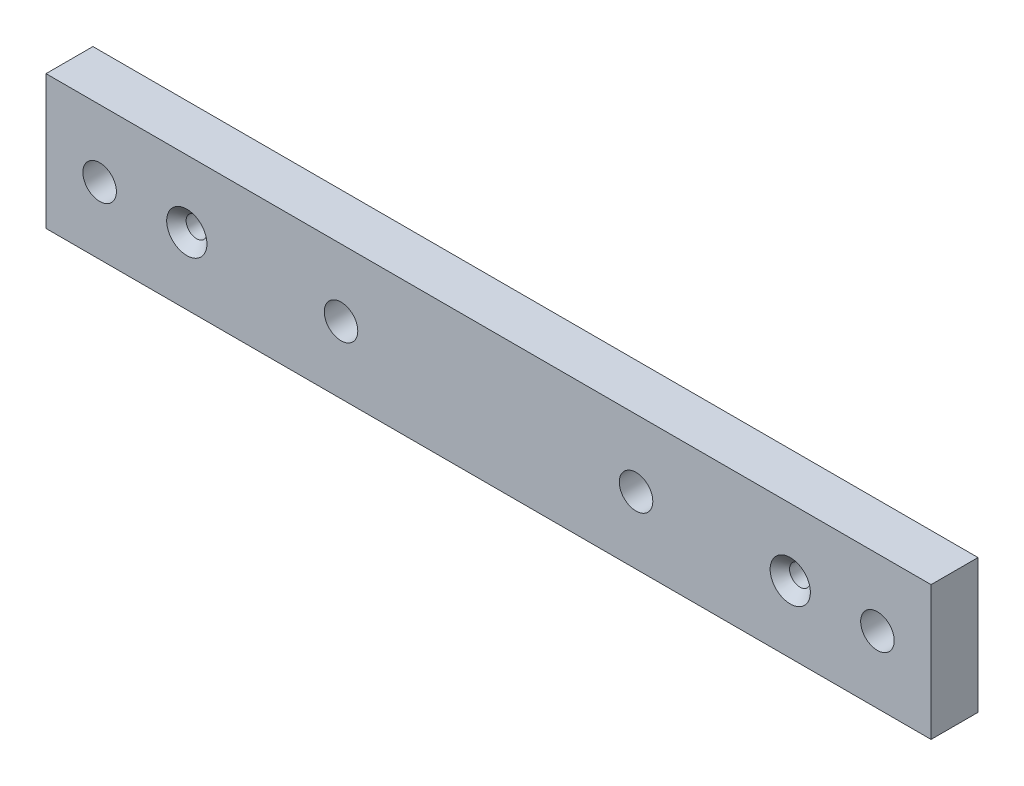
ISO-10303-21;
HEADER;
FILE_DESCRIPTION(('STEP AP214'),'2;1');
FILE_NAME('part.step','',(''),(''),'','','');
FILE_SCHEMA(('AUTOMOTIVE_DESIGN { 1 0 10303 214 1 1 1 1 }'));
ENDSEC;
DATA;
#1=APPLICATION_CONTEXT('core data for automotive mechanical design processes');
#2=APPLICATION_PROTOCOL_DEFINITION('international standard','automotive_design',2000,#1);
#3=PRODUCT_CONTEXT('',#1,'mechanical');
#4=PRODUCT('Part','Part','',(#3));
#5=PRODUCT_RELATED_PRODUCT_CATEGORY('part','',(#4));
#6=PRODUCT_DEFINITION_FORMATION('','',#4);
#7=PRODUCT_DEFINITION_CONTEXT('part definition',#1,'design');
#8=PRODUCT_DEFINITION('design','',#6,#7);
#9=PRODUCT_DEFINITION_SHAPE('','',#8);
#10=(LENGTH_UNIT() NAMED_UNIT(*) SI_UNIT(.MILLI.,.METRE.));
#11=(NAMED_UNIT(*) PLANE_ANGLE_UNIT() SI_UNIT($,.RADIAN.));
#12=(NAMED_UNIT(*) SI_UNIT($,.STERADIAN.) SOLID_ANGLE_UNIT());
#13=UNCERTAINTY_MEASURE_WITH_UNIT(LENGTH_MEASURE(1.E-05),#10,'distance_accuracy_value','');
#14=(GEOMETRIC_REPRESENTATION_CONTEXT(3) GLOBAL_UNCERTAINTY_ASSIGNED_CONTEXT((#13)) GLOBAL_UNIT_ASSIGNED_CONTEXT((#10,
#11,#12)) REPRESENTATION_CONTEXT('',''));
#15=CARTESIAN_POINT('',(0.,0.,0.));
#16=DIRECTION('',(0.,0.,1.));
#17=DIRECTION('',(1.,0.,0.));
#18=AXIS2_PLACEMENT_3D('',#15,#16,#17);
#19=CARTESIAN_POINT('',(0.,0.,7.));
#20=DIRECTION('',(0.,0.,-1.));
#21=DIRECTION('',(-1.,0.,0.));
#22=AXIS2_PLACEMENT_3D('',#19,#20,#21);
#23=PLANE('',#22);
#24=CARTESIAN_POINT('',(-58.,0.,7.));
#25=DIRECTION('',(0.,0.,1.));
#26=DIRECTION('',(1.,0.,0.));
#27=AXIS2_PLACEMENT_3D('',#24,#25,#26);
#28=CIRCLE('',#27,2.5);
#29=CARTESIAN_POINT('',(-55.5,0.,7.));
#30=VERTEX_POINT('',#29);
#31=EDGE_CURVE('E126',#30,#30,#28,.T.);
#32=ORIENTED_EDGE('',*,*,#31,.F.);
#33=EDGE_LOOP('',(#32));
#34=FACE_BOUND('',#33,.T.);
#35=CARTESIAN_POINT('',(58.,0.,7.));
#36=DIRECTION('',(0.,0.,1.));
#37=DIRECTION('',(1.,0.,0.));
#38=AXIS2_PLACEMENT_3D('',#35,#36,#37);
#39=CIRCLE('',#38,2.49999999999999);
#40=CARTESIAN_POINT('',(60.5,0.,7.));
#41=VERTEX_POINT('',#40);
#42=EDGE_CURVE('E120',#41,#41,#39,.T.);
#43=ORIENTED_EDGE('',*,*,#42,.F.);
#44=EDGE_LOOP('',(#43));
#45=FACE_BOUND('',#44,.T.);
#46=CARTESIAN_POINT('',(22.,0.,7.));
#47=DIRECTION('',(0.,0.,1.));
#48=DIRECTION('',(1.,0.,0.));
#49=AXIS2_PLACEMENT_3D('',#46,#47,#48);
#50=CIRCLE('',#49,2.5);
#51=CARTESIAN_POINT('',(24.5,0.,7.));
#52=VERTEX_POINT('',#51);
#53=EDGE_CURVE('E114',#52,#52,#50,.T.);
#54=ORIENTED_EDGE('',*,*,#53,.F.);
#55=EDGE_LOOP('',(#54));
#56=FACE_BOUND('',#55,.T.);
#57=CARTESIAN_POINT('',(-22.,0.,7.));
#58=DIRECTION('',(0.,0.,1.));
#59=DIRECTION('',(1.,0.,0.));
#60=AXIS2_PLACEMENT_3D('',#57,#58,#59);
#61=CIRCLE('',#60,2.5);
#62=CARTESIAN_POINT('',(-19.5,0.,7.));
#63=VERTEX_POINT('',#62);
#64=EDGE_CURVE('E99',#63,#63,#61,.T.);
#65=ORIENTED_EDGE('',*,*,#64,.F.);
#66=EDGE_LOOP('',(#65));
#67=FACE_BOUND('',#66,.T.);
#68=DIRECTION('',(0.,1.,0.));
#69=VECTOR('',#68,1.);
#70=CARTESIAN_POINT('',(66.,-10.,7.));
#71=LINE('',#70,#69);
#72=CARTESIAN_POINT('',(66.,-10.,7.));
#73=VERTEX_POINT('',#72);
#74=CARTESIAN_POINT('',(66.,10.,7.));
#75=VERTEX_POINT('',#74);
#76=EDGE_CURVE('E84',#73,#75,#71,.T.);
#77=ORIENTED_EDGE('',*,*,#76,.T.);
#78=DIRECTION('',(-1.,0.,0.));
#79=VECTOR('',#78,1.);
#80=CARTESIAN_POINT('',(-66.,10.,7.));
#81=LINE('',#80,#79);
#82=CARTESIAN_POINT('',(-66.,10.,7.));
#83=VERTEX_POINT('',#82);
#84=EDGE_CURVE('E79',#75,#83,#81,.T.);
#85=ORIENTED_EDGE('',*,*,#84,.T.);
#86=DIRECTION('',(0.,-1.,0.));
#87=VECTOR('',#86,1.);
#88=CARTESIAN_POINT('',(-66.,-10.,7.));
#89=LINE('',#88,#87);
#90=CARTESIAN_POINT('',(-66.,-10.,7.));
#91=VERTEX_POINT('',#90);
#92=EDGE_CURVE('E82',#83,#91,#89,.T.);
#93=ORIENTED_EDGE('',*,*,#92,.T.);
#94=DIRECTION('',(1.,0.,0.));
#95=VECTOR('',#94,1.);
#96=CARTESIAN_POINT('',(-66.,-10.,7.));
#97=LINE('',#96,#95);
#98=EDGE_CURVE('E49',#91,#73,#97,.T.);
#99=ORIENTED_EDGE('',*,*,#98,.T.);
#100=EDGE_LOOP('',(#77,#85,#93,#99));
#101=FACE_BOUND('',#100,.T.);
#102=CARTESIAN_POINT('',(45.,0.,7.));
#103=DIRECTION('',(0.,0.,1.));
#104=DIRECTION('',(1.,0.,0.));
#105=AXIS2_PLACEMENT_3D('',#102,#103,#104);
#106=CIRCLE('',#105,3.);
#107=CARTESIAN_POINT('',(48.,0.,7.));
#108=VERTEX_POINT('',#107);
#109=EDGE_CURVE('E140',#108,#108,#106,.T.);
#110=ORIENTED_EDGE('',*,*,#109,.F.);
#111=EDGE_LOOP('',(#110));
#112=FACE_BOUND('',#111,.T.);
#113=CARTESIAN_POINT('',(-45.,0.,7.));
#114=DIRECTION('',(0.,0.,1.));
#115=DIRECTION('',(1.,0.,0.));
#116=AXIS2_PLACEMENT_3D('',#113,#114,#115);
#117=CIRCLE('',#116,3.);
#118=CARTESIAN_POINT('',(-42.,0.,7.));
#119=VERTEX_POINT('',#118);
#120=EDGE_CURVE('E149',#119,#119,#117,.T.);
#121=ORIENTED_EDGE('',*,*,#120,.F.);
#122=EDGE_LOOP('',(#121));
#123=FACE_BOUND('',#122,.T.);
#124=ADVANCED_FACE('F32',(#34,#45,#56,#67,#101,#112,#123),#23,.F.);
#125=CARTESIAN_POINT('',(0.,0.,0.));
#126=DIRECTION('',(0.,0.,-1.));
#127=DIRECTION('',(-1.,0.,0.));
#128=AXIS2_PLACEMENT_3D('',#125,#126,#127);
#129=PLANE('',#128);
#130=CARTESIAN_POINT('',(-45.,0.,0.));
#131=DIRECTION('',(0.,0.,1.));
#132=DIRECTION('',(1.,0.,0.));
#133=AXIS2_PLACEMENT_3D('',#130,#131,#132);
#134=CIRCLE('',#133,1.55);
#135=CARTESIAN_POINT('',(-43.45,0.,0.));
#136=VERTEX_POINT('',#135);
#137=EDGE_CURVE('E143',#136,#136,#134,.T.);
#138=ORIENTED_EDGE('',*,*,#137,.T.);
#139=EDGE_LOOP('',(#138));
#140=FACE_BOUND('',#139,.T.);
#141=CARTESIAN_POINT('',(-58.,0.,0.));
#142=DIRECTION('',(0.,0.,1.));
#143=DIRECTION('',(1.,0.,0.));
#144=AXIS2_PLACEMENT_3D('',#141,#142,#143);
#145=CIRCLE('',#144,2.5);
#146=CARTESIAN_POINT('',(-55.5,0.,0.));
#147=VERTEX_POINT('',#146);
#148=EDGE_CURVE('E129',#147,#147,#145,.T.);
#149=ORIENTED_EDGE('',*,*,#148,.T.);
#150=EDGE_LOOP('',(#149));
#151=FACE_BOUND('',#150,.T.);
#152=CARTESIAN_POINT('',(22.,0.,0.));
#153=DIRECTION('',(0.,0.,1.));
#154=DIRECTION('',(1.,0.,0.));
#155=AXIS2_PLACEMENT_3D('',#152,#153,#154);
#156=CIRCLE('',#155,2.5);
#157=CARTESIAN_POINT('',(24.5,0.,0.));
#158=VERTEX_POINT('',#157);
#159=EDGE_CURVE('E117',#158,#158,#156,.T.);
#160=ORIENTED_EDGE('',*,*,#159,.T.);
#161=EDGE_LOOP('',(#160));
#162=FACE_BOUND('',#161,.T.);
#163=DIRECTION('',(0.,1.,0.));
#164=VECTOR('',#163,1.);
#165=CARTESIAN_POINT('',(66.,-10.,0.));
#166=LINE('',#165,#164);
#167=CARTESIAN_POINT('',(66.,-10.,0.));
#168=VERTEX_POINT('',#167);
#169=CARTESIAN_POINT('',(66.,10.,0.));
#170=VERTEX_POINT('',#169);
#171=EDGE_CURVE('E96',#168,#170,#166,.T.);
#172=ORIENTED_EDGE('',*,*,#171,.F.);
#173=DIRECTION('',(1.,0.,0.));
#174=VECTOR('',#173,1.);
#175=CARTESIAN_POINT('',(-66.,-10.,0.));
#176=LINE('',#175,#174);
#177=CARTESIAN_POINT('',(-66.,-10.,0.));
#178=VERTEX_POINT('',#177);
#179=EDGE_CURVE('E72',#178,#168,#176,.T.);
#180=ORIENTED_EDGE('',*,*,#179,.F.);
#181=DIRECTION('',(0.,-1.,0.));
#182=VECTOR('',#181,1.);
#183=CARTESIAN_POINT('',(-66.,-10.,0.));
#184=LINE('',#183,#182);
#185=CARTESIAN_POINT('',(-66.,10.,0.));
#186=VERTEX_POINT('',#185);
#187=EDGE_CURVE('E66',#186,#178,#184,.T.);
#188=ORIENTED_EDGE('',*,*,#187,.F.);
#189=DIRECTION('',(-1.,0.,0.));
#190=VECTOR('',#189,1.);
#191=CARTESIAN_POINT('',(-66.,10.,0.));
#192=LINE('',#191,#190);
#193=EDGE_CURVE('E88',#170,#186,#192,.T.);
#194=ORIENTED_EDGE('',*,*,#193,.F.);
#195=EDGE_LOOP('',(#172,#180,#188,#194));
#196=FACE_BOUND('',#195,.T.);
#197=CARTESIAN_POINT('',(-22.,0.,0.));
#198=DIRECTION('',(0.,0.,1.));
#199=DIRECTION('',(1.,0.,0.));
#200=AXIS2_PLACEMENT_3D('',#197,#198,#199);
#201=CIRCLE('',#200,2.5);
#202=CARTESIAN_POINT('',(-19.5,0.,0.));
#203=VERTEX_POINT('',#202);
#204=EDGE_CURVE('E111',#203,#203,#201,.T.);
#205=ORIENTED_EDGE('',*,*,#204,.T.);
#206=EDGE_LOOP('',(#205));
#207=FACE_BOUND('',#206,.T.);
#208=CARTESIAN_POINT('',(58.,0.,0.));
#209=DIRECTION('',(0.,0.,1.));
#210=DIRECTION('',(1.,0.,0.));
#211=AXIS2_PLACEMENT_3D('',#208,#209,#210);
#212=CIRCLE('',#211,2.49999999999999);
#213=CARTESIAN_POINT('',(60.5,0.,0.));
#214=VERTEX_POINT('',#213);
#215=EDGE_CURVE('E123',#214,#214,#212,.T.);
#216=ORIENTED_EDGE('',*,*,#215,.T.);
#217=EDGE_LOOP('',(#216));
#218=FACE_BOUND('',#217,.T.);
#219=CARTESIAN_POINT('',(45.,0.,0.));
#220=DIRECTION('',(0.,0.,1.));
#221=DIRECTION('',(1.,0.,0.));
#222=AXIS2_PLACEMENT_3D('',#219,#220,#221);
#223=CIRCLE('',#222,1.55);
#224=CARTESIAN_POINT('',(46.55,0.,0.));
#225=VERTEX_POINT('',#224);
#226=EDGE_CURVE('E132',#225,#225,#223,.T.);
#227=ORIENTED_EDGE('',*,*,#226,.T.);
#228=EDGE_LOOP('',(#227));
#229=FACE_BOUND('',#228,.T.);
#230=ADVANCED_FACE('F107',(#140,#151,#162,#196,#207,#218,#229),#129,.T.);
#231=CARTESIAN_POINT('',(66.,-10.,7.));
#232=DIRECTION('',(-1.,0.,0.));
#233=DIRECTION('',(0.,0.,1.));
#234=AXIS2_PLACEMENT_3D('',#231,#232,#233);
#235=PLANE('',#234);
#236=ORIENTED_EDGE('',*,*,#171,.T.);
#237=DIRECTION('',(0.,0.,-1.));
#238=VECTOR('',#237,1.);
#239=CARTESIAN_POINT('',(66.,10.,7.));
#240=LINE('',#239,#238);
#241=EDGE_CURVE('E11',#75,#170,#240,.T.);
#242=ORIENTED_EDGE('',*,*,#241,.F.);
#243=ORIENTED_EDGE('',*,*,#76,.F.);
#244=DIRECTION('',(0.,0.,-1.));
#245=VECTOR('',#244,1.);
#246=CARTESIAN_POINT('',(66.,-10.,7.));
#247=LINE('',#246,#245);
#248=EDGE_CURVE('E92',#73,#168,#247,.T.);
#249=ORIENTED_EDGE('',*,*,#248,.T.);
#250=EDGE_LOOP('',(#236,#242,#243,#249));
#251=FACE_BOUND('',#250,.T.);
#252=ADVANCED_FACE('F34',(#251),#235,.F.);
#253=CARTESIAN_POINT('',(-66.,10.,7.));
#254=DIRECTION('',(0.,-1.,0.));
#255=DIRECTION('',(0.,0.,-1.));
#256=AXIS2_PLACEMENT_3D('',#253,#254,#255);
#257=PLANE('',#256);
#258=ORIENTED_EDGE('',*,*,#193,.T.);
#259=DIRECTION('',(0.,0.,-1.));
#260=VECTOR('',#259,1.);
#261=CARTESIAN_POINT('',(-66.,10.,7.));
#262=LINE('',#261,#260);
#263=EDGE_CURVE('E41',#83,#186,#262,.T.);
#264=ORIENTED_EDGE('',*,*,#263,.F.);
#265=ORIENTED_EDGE('',*,*,#84,.F.);
#266=ORIENTED_EDGE('',*,*,#241,.T.);
#267=EDGE_LOOP('',(#258,#264,#265,#266));
#268=FACE_BOUND('',#267,.T.);
#269=ADVANCED_FACE('F87',(#268),#257,.F.);
#270=CARTESIAN_POINT('',(-66.,-10.,7.));
#271=DIRECTION('',(1.,0.,0.));
#272=DIRECTION('',(0.,0.,-1.));
#273=AXIS2_PLACEMENT_3D('',#270,#271,#272);
#274=PLANE('',#273);
#275=ORIENTED_EDGE('',*,*,#187,.T.);
#276=DIRECTION('',(0.,0.,-1.));
#277=VECTOR('',#276,1.);
#278=CARTESIAN_POINT('',(-66.,-10.,7.));
#279=LINE('',#278,#277);
#280=EDGE_CURVE('E89',#91,#178,#279,.T.);
#281=ORIENTED_EDGE('',*,*,#280,.F.);
#282=ORIENTED_EDGE('',*,*,#92,.F.);
#283=ORIENTED_EDGE('',*,*,#263,.T.);
#284=EDGE_LOOP('',(#275,#281,#282,#283));
#285=FACE_BOUND('',#284,.T.);
#286=ADVANCED_FACE('F90',(#285),#274,.F.);
#287=CARTESIAN_POINT('',(-66.,-10.,7.));
#288=DIRECTION('',(0.,1.,0.));
#289=DIRECTION('',(0.,0.,1.));
#290=AXIS2_PLACEMENT_3D('',#287,#288,#289);
#291=PLANE('',#290);
#292=ORIENTED_EDGE('',*,*,#179,.T.);
#293=ORIENTED_EDGE('',*,*,#248,.F.);
#294=ORIENTED_EDGE('',*,*,#98,.F.);
#295=ORIENTED_EDGE('',*,*,#280,.T.);
#296=EDGE_LOOP('',(#292,#293,#294,#295));
#297=FACE_BOUND('',#296,.T.);
#298=ADVANCED_FACE('F104',(#297),#291,.F.);
#299=CARTESIAN_POINT('',(-22.,0.,7.));
#300=DIRECTION('',(0.,0.,-1.));
#301=DIRECTION('',(-1.,0.,0.));
#302=AXIS2_PLACEMENT_3D('',#299,#300,#301);
#303=CYLINDRICAL_SURFACE('',#302,2.5);
#304=ORIENTED_EDGE('',*,*,#64,.T.);
#305=EDGE_LOOP('',(#304));
#306=FACE_BOUND('',#305,.T.);
#307=ORIENTED_EDGE('',*,*,#204,.F.);
#308=EDGE_LOOP('',(#307));
#309=FACE_BOUND('',#308,.T.);
#310=ADVANCED_FACE('F166',(#306,#309),#303,.F.);
#311=CARTESIAN_POINT('',(22.,0.,7.));
#312=DIRECTION('',(0.,0.,-1.));
#313=DIRECTION('',(-1.,0.,0.));
#314=AXIS2_PLACEMENT_3D('',#311,#312,#313);
#315=CYLINDRICAL_SURFACE('',#314,2.5);
#316=ORIENTED_EDGE('',*,*,#53,.T.);
#317=EDGE_LOOP('',(#316));
#318=FACE_BOUND('',#317,.T.);
#319=ORIENTED_EDGE('',*,*,#159,.F.);
#320=EDGE_LOOP('',(#319));
#321=FACE_BOUND('',#320,.T.);
#322=ADVANCED_FACE('F237',(#318,#321),#315,.F.);
#323=CARTESIAN_POINT('',(58.,0.,7.));
#324=DIRECTION('',(0.,0.,-1.));
#325=DIRECTION('',(-1.,0.,0.));
#326=AXIS2_PLACEMENT_3D('',#323,#324,#325);
#327=CYLINDRICAL_SURFACE('',#326,2.49999999999999);
#328=ORIENTED_EDGE('',*,*,#42,.T.);
#329=EDGE_LOOP('',(#328));
#330=FACE_BOUND('',#329,.T.);
#331=ORIENTED_EDGE('',*,*,#215,.F.);
#332=EDGE_LOOP('',(#331));
#333=FACE_BOUND('',#332,.T.);
#334=ADVANCED_FACE('F234',(#330,#333),#327,.F.);
#335=CARTESIAN_POINT('',(-58.,0.,7.));
#336=DIRECTION('',(0.,0.,-1.));
#337=DIRECTION('',(-1.,0.,0.));
#338=AXIS2_PLACEMENT_3D('',#335,#336,#337);
#339=CYLINDRICAL_SURFACE('',#338,2.5);
#340=ORIENTED_EDGE('',*,*,#31,.T.);
#341=EDGE_LOOP('',(#340));
#342=FACE_BOUND('',#341,.T.);
#343=ORIENTED_EDGE('',*,*,#148,.F.);
#344=EDGE_LOOP('',(#343));
#345=FACE_BOUND('',#344,.T.);
#346=ADVANCED_FACE('F197',(#342,#345),#339,.F.);
#347=CARTESIAN_POINT('',(45.,0.,7.));
#348=DIRECTION('',(0.,0.,1.));
#349=DIRECTION('',(1.,0.,0.));
#350=AXIS2_PLACEMENT_3D('',#347,#348,#349);
#351=CYLINDRICAL_SURFACE('',#350,1.55);
#352=ORIENTED_EDGE('',*,*,#226,.F.);
#353=EDGE_LOOP('',(#352));
#354=FACE_BOUND('',#353,.T.);
#355=CARTESIAN_POINT('',(45.,0.,5.55));
#356=DIRECTION('',(0.,0.,1.));
#357=DIRECTION('',(1.,0.,0.));
#358=AXIS2_PLACEMENT_3D('',#355,#356,#357);
#359=CIRCLE('',#358,1.55);
#360=CARTESIAN_POINT('',(46.55,0.,5.55));
#361=VERTEX_POINT('',#360);
#362=EDGE_CURVE('E137',#361,#361,#359,.T.);
#363=ORIENTED_EDGE('',*,*,#362,.T.);
#364=EDGE_LOOP('',(#363));
#365=FACE_BOUND('',#364,.T.);
#366=ADVANCED_FACE('F191',(#354,#365),#351,.F.);
#367=CARTESIAN_POINT('',(45.,0.,7.));
#368=DIRECTION('',(0.,0.,1.));
#369=DIRECTION('',(1.,0.,0.));
#370=AXIS2_PLACEMENT_3D('',#367,#368,#369);
#371=CONICAL_SURFACE('',#370,3.,0.78539816339745);
#372=ORIENTED_EDGE('',*,*,#362,.F.);
#373=EDGE_LOOP('',(#372));
#374=FACE_BOUND('',#373,.T.);
#375=ORIENTED_EDGE('',*,*,#109,.T.);
#376=EDGE_LOOP('',(#375));
#377=FACE_BOUND('',#376,.T.);
#378=ADVANCED_FACE('F196',(#374,#377),#371,.F.);
#379=CARTESIAN_POINT('',(-45.,0.,7.));
#380=DIRECTION('',(0.,0.,1.));
#381=DIRECTION('',(1.,0.,0.));
#382=AXIS2_PLACEMENT_3D('',#379,#380,#381);
#383=CYLINDRICAL_SURFACE('',#382,1.55);
#384=ORIENTED_EDGE('',*,*,#137,.F.);
#385=EDGE_LOOP('',(#384));
#386=FACE_BOUND('',#385,.T.);
#387=CARTESIAN_POINT('',(-45.,0.,5.55));
#388=DIRECTION('',(0.,0.,1.));
#389=DIRECTION('',(1.,0.,0.));
#390=AXIS2_PLACEMENT_3D('',#387,#388,#389);
#391=CIRCLE('',#390,1.55);
#392=CARTESIAN_POINT('',(-43.45,0.,5.55));
#393=VERTEX_POINT('',#392);
#394=EDGE_CURVE('E146',#393,#393,#391,.T.);
#395=ORIENTED_EDGE('',*,*,#394,.T.);
#396=EDGE_LOOP('',(#395));
#397=FACE_BOUND('',#396,.T.);
#398=ADVANCED_FACE('F208',(#386,#397),#383,.F.);
#399=CARTESIAN_POINT('',(-45.,0.,7.));
#400=DIRECTION('',(0.,0.,1.));
#401=DIRECTION('',(1.,0.,0.));
#402=AXIS2_PLACEMENT_3D('',#399,#400,#401);
#403=CONICAL_SURFACE('',#402,3.,0.78539816339745);
#404=ORIENTED_EDGE('',*,*,#394,.F.);
#405=EDGE_LOOP('',(#404));
#406=FACE_BOUND('',#405,.T.);
#407=ORIENTED_EDGE('',*,*,#120,.T.);
#408=EDGE_LOOP('',(#407));
#409=FACE_BOUND('',#408,.T.);
#410=ADVANCED_FACE('F153',(#406,#409),#403,.F.);
#411=CLOSED_SHELL('',(#124,#230,#252,#269,#286,#298,#310,#322,#334,#346,#366,#378,#398,#410));
#412=MANIFOLD_SOLID_BREP('B2',#411);
#413=ADVANCED_BREP_SHAPE_REPRESENTATION('',(#18,#412),#14);
#414=SHAPE_DEFINITION_REPRESENTATION(#9,#413);
ENDSEC;
END-ISO-10303-21;
